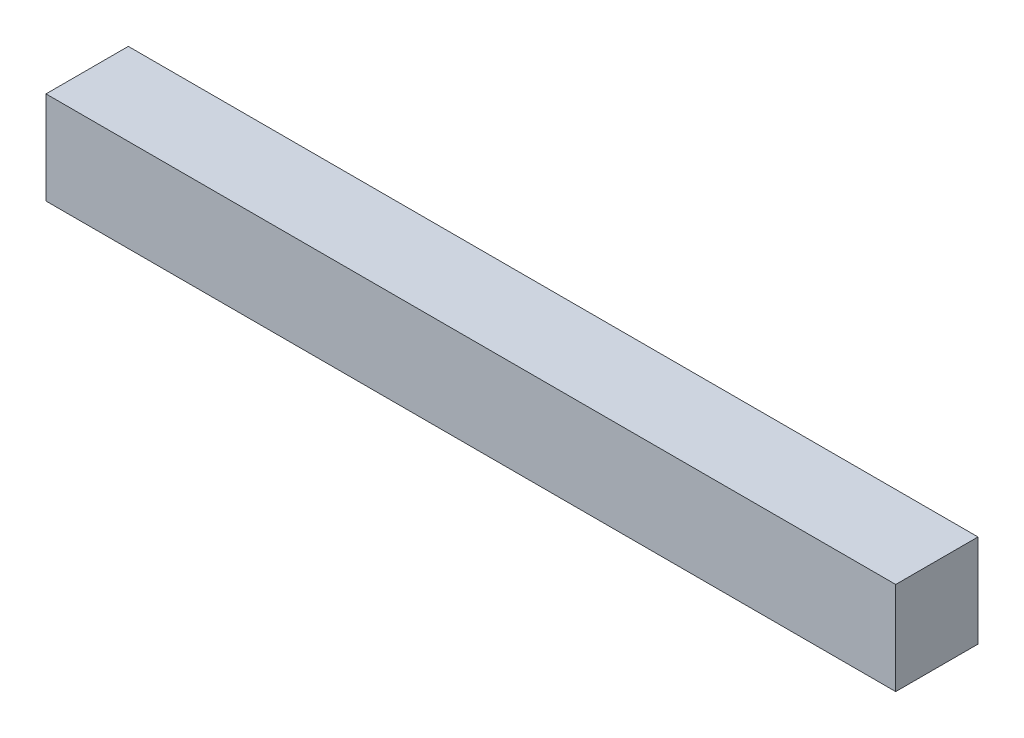
ISO-10303-21;
HEADER;
FILE_DESCRIPTION(('STEP AP214'),'2;1');
FILE_NAME('part.step','',(''),(''),'','','');
FILE_SCHEMA(('AUTOMOTIVE_DESIGN { 1 0 10303 214 1 1 1 1 }'));
ENDSEC;
DATA;
#1=APPLICATION_CONTEXT('core data for automotive mechanical design processes');
#2=APPLICATION_PROTOCOL_DEFINITION('international standard','automotive_design',2000,#1);
#3=PRODUCT_CONTEXT('',#1,'mechanical');
#4=PRODUCT('Part','Part','',(#3));
#5=PRODUCT_RELATED_PRODUCT_CATEGORY('part','',(#4));
#6=PRODUCT_DEFINITION_FORMATION('','',#4);
#7=PRODUCT_DEFINITION_CONTEXT('part definition',#1,'design');
#8=PRODUCT_DEFINITION('design','',#6,#7);
#9=PRODUCT_DEFINITION_SHAPE('','',#8);
#10=(LENGTH_UNIT() NAMED_UNIT(*) SI_UNIT(.MILLI.,.METRE.));
#11=(NAMED_UNIT(*) PLANE_ANGLE_UNIT() SI_UNIT($,.RADIAN.));
#12=(NAMED_UNIT(*) SI_UNIT($,.STERADIAN.) SOLID_ANGLE_UNIT());
#13=UNCERTAINTY_MEASURE_WITH_UNIT(LENGTH_MEASURE(1.E-05),#10,'distance_accuracy_value','');
#14=(GEOMETRIC_REPRESENTATION_CONTEXT(3) GLOBAL_UNCERTAINTY_ASSIGNED_CONTEXT((#13)) GLOBAL_UNIT_ASSIGNED_CONTEXT((#10,
#11,#12)) REPRESENTATION_CONTEXT('',''));
#15=CARTESIAN_POINT('',(0.,0.,0.));
#16=DIRECTION('',(0.,0.,1.));
#17=DIRECTION('',(1.,0.,0.));
#18=AXIS2_PLACEMENT_3D('',#15,#16,#17);
#19=CARTESIAN_POINT('',(-11763.1950640645,4974.93912667163,100.));
#20=DIRECTION('',(-1.,0.,0.));
#21=DIRECTION('',(0.,0.,1.));
#22=AXIS2_PLACEMENT_3D('',#19,#20,#21);
#23=PLANE('',#22);
#24=DIRECTION('',(0.,1.,0.));
#25=VECTOR('',#24,1.);
#26=CARTESIAN_POINT('',(-11763.1950640645,4974.93912667163,0.));
#27=LINE('',#26,#25);
#28=CARTESIAN_POINT('',(-11763.1950640645,4862.15211646301,0.));
#29=VERTEX_POINT('',#28);
#30=CARTESIAN_POINT('',(-11763.1950640645,4974.93912667163,0.));
#31=VERTEX_POINT('',#30);
#32=EDGE_CURVE('E96',#29,#31,#27,.T.);
#33=ORIENTED_EDGE('',*,*,#32,.T.);
#34=DIRECTION('',(0.,0.,-1.));
#35=VECTOR('',#34,1.);
#36=CARTESIAN_POINT('',(-11763.1950640645,4974.93912667163,100.));
#37=LINE('',#36,#35);
#38=CARTESIAN_POINT('',(-11763.1950640645,4974.93912667163,100.));
#39=VERTEX_POINT('',#38);
#40=EDGE_CURVE('E11',#39,#31,#37,.T.);
#41=ORIENTED_EDGE('',*,*,#40,.F.);
#42=DIRECTION('',(0.,1.,0.));
#43=VECTOR('',#42,1.);
#44=CARTESIAN_POINT('',(-11763.1950640645,4974.93912667163,100.));
#45=LINE('',#44,#43);
#46=CARTESIAN_POINT('',(-11763.1950640645,4862.15211646301,100.));
#47=VERTEX_POINT('',#46);
#48=EDGE_CURVE('E84',#47,#39,#45,.T.);
#49=ORIENTED_EDGE('',*,*,#48,.F.);
#50=DIRECTION('',(0.,0.,-1.));
#51=VECTOR('',#50,1.);
#52=CARTESIAN_POINT('',(-11763.1950640645,4862.15211646301,100.));
#53=LINE('',#52,#51);
#54=EDGE_CURVE('E92',#47,#29,#53,.T.);
#55=ORIENTED_EDGE('',*,*,#54,.T.);
#56=EDGE_LOOP('',(#33,#41,#49,#55));
#57=FACE_BOUND('',#56,.T.);
#58=ADVANCED_FACE('F33',(#57),#23,.F.);
#59=CARTESIAN_POINT('',(-11763.1950640645,4974.93912667163,100.));
#60=DIRECTION('',(0.,-1.,0.));
#61=DIRECTION('',(0.,0.,-1.));
#62=AXIS2_PLACEMENT_3D('',#59,#60,#61);
#63=PLANE('',#62);
#64=DIRECTION('',(-1.,0.,0.));
#65=VECTOR('',#64,1.);
#66=CARTESIAN_POINT('',(-11763.1950640645,4974.93912667163,0.));
#67=LINE('',#66,#65);
#68=CARTESIAN_POINT('',(-12795.6707514204,4974.93912667163,0.));
#69=VERTEX_POINT('',#68);
#70=EDGE_CURVE('E88',#31,#69,#67,.T.);
#71=ORIENTED_EDGE('',*,*,#70,.T.);
#72=DIRECTION('',(0.,0.,-1.));
#73=VECTOR('',#72,1.);
#74=CARTESIAN_POINT('',(-12795.6707514204,4974.93912667163,100.));
#75=LINE('',#74,#73);
#76=CARTESIAN_POINT('',(-12795.6707514204,4974.93912667163,100.));
#77=VERTEX_POINT('',#76);
#78=EDGE_CURVE('E41',#77,#69,#75,.T.);
#79=ORIENTED_EDGE('',*,*,#78,.F.);
#80=DIRECTION('',(-1.,0.,0.));
#81=VECTOR('',#80,1.);
#82=CARTESIAN_POINT('',(-11763.1950640645,4974.93912667163,100.));
#83=LINE('',#82,#81);
#84=EDGE_CURVE('E79',#39,#77,#83,.T.);
#85=ORIENTED_EDGE('',*,*,#84,.F.);
#86=ORIENTED_EDGE('',*,*,#40,.T.);
#87=EDGE_LOOP('',(#71,#79,#85,#86));
#88=FACE_BOUND('',#87,.T.);
#89=ADVANCED_FACE('F87',(#88),#63,.F.);
#90=CARTESIAN_POINT('',(-12795.6707514204,4974.93912667163,100.));
#91=DIRECTION('',(1.,0.,0.));
#92=DIRECTION('',(0.,0.,-1.));
#93=AXIS2_PLACEMENT_3D('',#90,#91,#92);
#94=PLANE('',#93);
#95=DIRECTION('',(0.,-1.,0.));
#96=VECTOR('',#95,1.);
#97=CARTESIAN_POINT('',(-12795.6707514204,4974.93912667163,0.));
#98=LINE('',#97,#96);
#99=CARTESIAN_POINT('',(-12795.6707514204,4862.15211646301,0.));
#100=VERTEX_POINT('',#99);
#101=EDGE_CURVE('E66',#69,#100,#98,.T.);
#102=ORIENTED_EDGE('',*,*,#101,.T.);
#103=DIRECTION('',(0.,0.,-1.));
#104=VECTOR('',#103,1.);
#105=CARTESIAN_POINT('',(-12795.6707514204,4862.15211646301,100.));
#106=LINE('',#105,#104);
#107=CARTESIAN_POINT('',(-12795.6707514204,4862.15211646301,100.));
#108=VERTEX_POINT('',#107);
#109=EDGE_CURVE('E89',#108,#100,#106,.T.);
#110=ORIENTED_EDGE('',*,*,#109,.F.);
#111=DIRECTION('',(0.,-1.,0.));
#112=VECTOR('',#111,1.);
#113=CARTESIAN_POINT('',(-12795.6707514204,4974.93912667163,100.));
#114=LINE('',#113,#112);
#115=EDGE_CURVE('E82',#77,#108,#114,.T.);
#116=ORIENTED_EDGE('',*,*,#115,.F.);
#117=ORIENTED_EDGE('',*,*,#78,.T.);
#118=EDGE_LOOP('',(#102,#110,#116,#117));
#119=FACE_BOUND('',#118,.T.);
#120=ADVANCED_FACE('F90',(#119),#94,.F.);
#121=CARTESIAN_POINT('',(-11763.1950640645,4862.15211646301,100.));
#122=DIRECTION('',(0.,1.,0.));
#123=DIRECTION('',(0.,0.,1.));
#124=AXIS2_PLACEMENT_3D('',#121,#122,#123);
#125=PLANE('',#124);
#126=DIRECTION('',(1.,0.,0.));
#127=VECTOR('',#126,1.);
#128=CARTESIAN_POINT('',(-11763.1950640645,4862.15211646301,0.));
#129=LINE('',#128,#127);
#130=EDGE_CURVE('E72',#100,#29,#129,.T.);
#131=ORIENTED_EDGE('',*,*,#130,.T.);
#132=ORIENTED_EDGE('',*,*,#54,.F.);
#133=DIRECTION('',(1.,0.,0.));
#134=VECTOR('',#133,1.);
#135=CARTESIAN_POINT('',(-11763.1950640645,4862.15211646301,100.));
#136=LINE('',#135,#134);
#137=EDGE_CURVE('E49',#108,#47,#136,.T.);
#138=ORIENTED_EDGE('',*,*,#137,.F.);
#139=ORIENTED_EDGE('',*,*,#109,.T.);
#140=EDGE_LOOP('',(#131,#132,#138,#139));
#141=FACE_BOUND('',#140,.T.);
#142=ADVANCED_FACE('F103',(#141),#125,.F.);
#143=CARTESIAN_POINT('',(-11763.1950640645,4862.15211646301,100.));
#144=DIRECTION('',(0.,0.,-1.));
#145=DIRECTION('',(-1.,0.,0.));
#146=AXIS2_PLACEMENT_3D('',#143,#144,#145);
#147=PLANE('',#146);
#148=ORIENTED_EDGE('',*,*,#48,.T.);
#149=ORIENTED_EDGE('',*,*,#84,.T.);
#150=ORIENTED_EDGE('',*,*,#115,.T.);
#151=ORIENTED_EDGE('',*,*,#137,.T.);
#152=EDGE_LOOP('',(#148,#149,#150,#151));
#153=FACE_BOUND('',#152,.T.);
#154=ADVANCED_FACE('F80',(#153),#147,.F.);
#155=CARTESIAN_POINT('',(-11763.1950640645,4862.15211646301,0.));
#156=DIRECTION('',(0.,0.,-1.));
#157=DIRECTION('',(-1.,0.,0.));
#158=AXIS2_PLACEMENT_3D('',#155,#156,#157);
#159=PLANE('',#158);
#160=ORIENTED_EDGE('',*,*,#32,.F.);
#161=ORIENTED_EDGE('',*,*,#130,.F.);
#162=ORIENTED_EDGE('',*,*,#101,.F.);
#163=ORIENTED_EDGE('',*,*,#70,.F.);
#164=EDGE_LOOP('',(#160,#161,#162,#163));
#165=FACE_BOUND('',#164,.T.);
#166=ADVANCED_FACE('F106',(#165),#159,.T.);
#167=CLOSED_SHELL('',(#58,#89,#120,#142,#154,#166));
#168=MANIFOLD_SOLID_BREP('B2',#167);
#169=ADVANCED_BREP_SHAPE_REPRESENTATION('',(#18,#168),#14);
#170=SHAPE_DEFINITION_REPRESENTATION(#9,#169);
ENDSEC;
END-ISO-10303-21;
